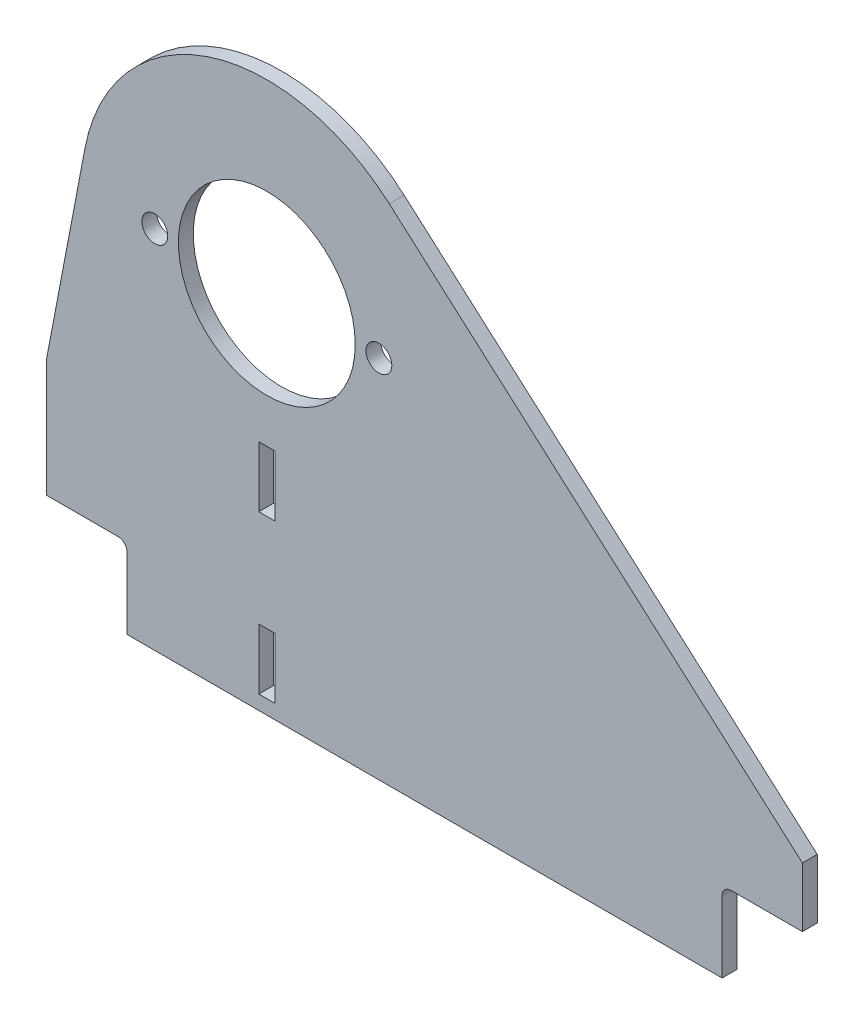
ISO-10303-21;
HEADER;
FILE_DESCRIPTION(('STEP AP214'),'2;1');
FILE_NAME('part.step','',(''),(''),'','','');
FILE_SCHEMA(('AUTOMOTIVE_DESIGN { 1 0 10303 214 1 1 1 1 }'));
ENDSEC;
DATA;
#1=APPLICATION_CONTEXT('core data for automotive mechanical design processes');
#2=APPLICATION_PROTOCOL_DEFINITION('international standard','automotive_design',2000,#1);
#3=PRODUCT_CONTEXT('',#1,'mechanical');
#4=PRODUCT('Part','Part','',(#3));
#5=PRODUCT_RELATED_PRODUCT_CATEGORY('part','',(#4));
#6=PRODUCT_DEFINITION_FORMATION('','',#4);
#7=PRODUCT_DEFINITION_CONTEXT('part definition',#1,'design');
#8=PRODUCT_DEFINITION('design','',#6,#7);
#9=PRODUCT_DEFINITION_SHAPE('','',#8);
#10=(LENGTH_UNIT() NAMED_UNIT(*) SI_UNIT(.MILLI.,.METRE.));
#11=(NAMED_UNIT(*) PLANE_ANGLE_UNIT() SI_UNIT($,.RADIAN.));
#12=(NAMED_UNIT(*) SI_UNIT($,.STERADIAN.) SOLID_ANGLE_UNIT());
#13=UNCERTAINTY_MEASURE_WITH_UNIT(LENGTH_MEASURE(1.E-05),#10,'distance_accuracy_value','');
#14=(GEOMETRIC_REPRESENTATION_CONTEXT(3) GLOBAL_UNCERTAINTY_ASSIGNED_CONTEXT((#13)) GLOBAL_UNIT_ASSIGNED_CONTEXT((#10,
#11,#12)) REPRESENTATION_CONTEXT('',''));
#15=CARTESIAN_POINT('',(0.,0.,0.));
#16=DIRECTION('',(0.,0.,1.));
#17=DIRECTION('',(1.,0.,0.));
#18=AXIS2_PLACEMENT_3D('',#15,#16,#17);
#19=CARTESIAN_POINT('',(156.076706029105,-3.00000000000025,-5.));
#20=DIRECTION('',(0.,0.,1.));
#21=DIRECTION('',(1.,0.,0.));
#22=AXIS2_PLACEMENT_3D('',#19,#20,#21);
#23=CYLINDRICAL_SURFACE('',#22,3.);
#24=CARTESIAN_POINT('',(156.076706029105,-3.00000000000025,0.));
#25=DIRECTION('',(0.,0.,-1.));
#26=DIRECTION('',(1.,0.,0.));
#27=AXIS2_PLACEMENT_3D('',#24,#25,#26);
#28=CIRCLE('',#27,3.);
#29=CARTESIAN_POINT('',(153.076706029105,-3.00000000000027,0.));
#30=VERTEX_POINT('',#29);
#31=CARTESIAN_POINT('',(156.076706029105,-2.4980018054066E-13,0.));
#32=VERTEX_POINT('',#31);
#33=EDGE_CURVE('E282',#30,#32,#28,.T.);
#34=ORIENTED_EDGE('',*,*,#33,.F.);
#35=DIRECTION('',(0.,0.,1.));
#36=VECTOR('',#35,1.);
#37=CARTESIAN_POINT('',(153.076706029105,-3.00000000000027,-5.));
#38=LINE('',#37,#36);
#39=CARTESIAN_POINT('',(153.076706029105,-3.00000000000027,-5.));
#40=VERTEX_POINT('',#39);
#41=EDGE_CURVE('E11',#40,#30,#38,.T.);
#42=ORIENTED_EDGE('',*,*,#41,.F.);
#43=CARTESIAN_POINT('',(156.076706029105,-3.00000000000025,-5.));
#44=DIRECTION('',(0.,0.,-1.));
#45=DIRECTION('',(1.,0.,0.));
#46=AXIS2_PLACEMENT_3D('',#43,#44,#45);
#47=CIRCLE('',#46,3.);
#48=CARTESIAN_POINT('',(156.076706029105,-2.4980018054066E-13,-5.));
#49=VERTEX_POINT('',#48);
#50=EDGE_CURVE('E285',#40,#49,#47,.T.);
#51=ORIENTED_EDGE('',*,*,#50,.T.);
#52=DIRECTION('',(0.,0.,1.));
#53=VECTOR('',#52,1.);
#54=CARTESIAN_POINT('',(156.076706029105,-2.4980018054066E-13,-5.));
#55=LINE('',#54,#53);
#56=EDGE_CURVE('E40',#49,#32,#55,.T.);
#57=ORIENTED_EDGE('',*,*,#56,.T.);
#58=EDGE_LOOP('',(#34,#42,#51,#57));
#59=FACE_BOUND('',#58,.T.);
#60=ADVANCED_FACE('F37',(#59),#23,.F.);
#61=CARTESIAN_POINT('',(153.076706029105,-3.00000000000027,-5.));
#62=DIRECTION('',(1.,0.,0.));
#63=DIRECTION('',(0.,0.,-1.));
#64=AXIS2_PLACEMENT_3D('',#61,#62,#63);
#65=PLANE('',#64);
#66=DIRECTION('',(0.,1.,0.));
#67=VECTOR('',#66,1.);
#68=CARTESIAN_POINT('',(153.076706029105,-3.00000000000027,0.));
#69=LINE('',#68,#67);
#70=CARTESIAN_POINT('',(153.076706029105,-27.0000000000002,0.));
#71=VERTEX_POINT('',#70);
#72=EDGE_CURVE('E289',#71,#30,#69,.T.);
#73=ORIENTED_EDGE('',*,*,#72,.F.);
#74=DIRECTION('',(0.,0.,1.));
#75=VECTOR('',#74,1.);
#76=CARTESIAN_POINT('',(153.076706029105,-27.0000000000002,-5.));
#77=LINE('',#76,#75);
#78=CARTESIAN_POINT('',(153.076706029105,-27.0000000000002,-5.));
#79=VERTEX_POINT('',#78);
#80=EDGE_CURVE('E45',#79,#71,#77,.T.);
#81=ORIENTED_EDGE('',*,*,#80,.F.);
#82=DIRECTION('',(0.,1.,0.));
#83=VECTOR('',#82,1.);
#84=CARTESIAN_POINT('',(153.076706029105,-3.00000000000027,-5.));
#85=LINE('',#84,#83);
#86=EDGE_CURVE('E319',#79,#40,#85,.T.);
#87=ORIENTED_EDGE('',*,*,#86,.T.);
#88=ORIENTED_EDGE('',*,*,#41,.T.);
#89=EDGE_LOOP('',(#73,#81,#87,#88));
#90=FACE_BOUND('',#89,.T.);
#91=ADVANCED_FACE('F385',(#90),#65,.T.);
#92=CARTESIAN_POINT('',(-47.,-27.,-5.));
#93=DIRECTION('',(0.,-1.,0.));
#94=DIRECTION('',(1.,0.,0.));
#95=AXIS2_PLACEMENT_3D('',#92,#93,#94);
#96=PLANE('',#95);
#97=DIRECTION('',(1.,0.,0.));
#98=VECTOR('',#97,1.);
#99=CARTESIAN_POINT('',(-47.,-27.,0.));
#100=LINE('',#99,#98);
#101=CARTESIAN_POINT('',(-47.,-27.,0.));
#102=VERTEX_POINT('',#101);
#103=EDGE_CURVE('E351',#102,#71,#100,.T.);
#104=ORIENTED_EDGE('',*,*,#103,.F.);
#105=DIRECTION('',(0.,0.,1.));
#106=VECTOR('',#105,1.);
#107=CARTESIAN_POINT('',(-47.,-27.,-5.));
#108=LINE('',#107,#106);
#109=CARTESIAN_POINT('',(-47.,-27.,-5.));
#110=VERTEX_POINT('',#109);
#111=EDGE_CURVE('E357',#110,#102,#108,.T.);
#112=ORIENTED_EDGE('',*,*,#111,.F.);
#113=DIRECTION('',(1.,0.,0.));
#114=VECTOR('',#113,1.);
#115=CARTESIAN_POINT('',(-47.,-27.,-5.));
#116=LINE('',#115,#114);
#117=EDGE_CURVE('E316',#110,#79,#116,.T.);
#118=ORIENTED_EDGE('',*,*,#117,.T.);
#119=ORIENTED_EDGE('',*,*,#80,.T.);
#120=EDGE_LOOP('',(#104,#112,#118,#119));
#121=FACE_BOUND('',#120,.T.);
#122=ADVANCED_FACE('F422',(#121),#96,.T.);
#123=CARTESIAN_POINT('',(-47.,-27.,-5.));
#124=DIRECTION('',(-1.,0.,0.));
#125=DIRECTION('',(0.,0.,1.));
#126=AXIS2_PLACEMENT_3D('',#123,#124,#125);
#127=PLANE('',#126);
#128=DIRECTION('',(0.,-1.,0.));
#129=VECTOR('',#128,1.);
#130=CARTESIAN_POINT('',(-47.,-27.,0.));
#131=LINE('',#130,#129);
#132=CARTESIAN_POINT('',(-47.,-3.00000000000003,0.));
#133=VERTEX_POINT('',#132);
#134=EDGE_CURVE('E348',#133,#102,#131,.T.);
#135=ORIENTED_EDGE('',*,*,#134,.F.);
#136=DIRECTION('',(0.,0.,1.));
#137=VECTOR('',#136,1.);
#138=CARTESIAN_POINT('',(-47.,-3.00000000000003,-5.));
#139=LINE('',#138,#137);
#140=CARTESIAN_POINT('',(-47.,-3.00000000000003,-5.));
#141=VERTEX_POINT('',#140);
#142=EDGE_CURVE('E359',#141,#133,#139,.T.);
#143=ORIENTED_EDGE('',*,*,#142,.F.);
#144=DIRECTION('',(0.,-1.,0.));
#145=VECTOR('',#144,1.);
#146=CARTESIAN_POINT('',(-47.,-27.,-5.));
#147=LINE('',#146,#145);
#148=EDGE_CURVE('E313',#141,#110,#147,.T.);
#149=ORIENTED_EDGE('',*,*,#148,.T.);
#150=ORIENTED_EDGE('',*,*,#111,.T.);
#151=EDGE_LOOP('',(#135,#143,#149,#150));
#152=FACE_BOUND('',#151,.T.);
#153=ADVANCED_FACE('F419',(#152),#127,.T.);
#154=CARTESIAN_POINT('',(-50.,-3.00000000000003,-5.));
#155=DIRECTION('',(0.,0.,1.));
#156=DIRECTION('',(1.,0.,0.));
#157=AXIS2_PLACEMENT_3D('',#154,#155,#156);
#158=CYLINDRICAL_SURFACE('',#157,3.);
#159=CARTESIAN_POINT('',(-50.,-3.00000000000003,0.));
#160=DIRECTION('',(0.,0.,-1.));
#161=DIRECTION('',(1.,0.,0.));
#162=AXIS2_PLACEMENT_3D('',#159,#160,#161);
#163=CIRCLE('',#162,3.);
#164=CARTESIAN_POINT('',(-50.,0.,0.));
#165=VERTEX_POINT('',#164);
#166=EDGE_CURVE('E345',#165,#133,#163,.T.);
#167=ORIENTED_EDGE('',*,*,#166,.F.);
#168=DIRECTION('',(0.,0.,1.));
#169=VECTOR('',#168,1.);
#170=CARTESIAN_POINT('',(-50.,0.,-5.));
#171=LINE('',#170,#169);
#172=CARTESIAN_POINT('',(-50.,0.,-5.));
#173=VERTEX_POINT('',#172);
#174=EDGE_CURVE('E361',#173,#165,#171,.T.);
#175=ORIENTED_EDGE('',*,*,#174,.F.);
#176=CARTESIAN_POINT('',(-50.,-3.00000000000003,-5.));
#177=DIRECTION('',(0.,0.,-1.));
#178=DIRECTION('',(1.,0.,0.));
#179=AXIS2_PLACEMENT_3D('',#176,#177,#178);
#180=CIRCLE('',#179,3.);
#181=EDGE_CURVE('E310',#173,#141,#180,.T.);
#182=ORIENTED_EDGE('',*,*,#181,.T.);
#183=ORIENTED_EDGE('',*,*,#142,.T.);
#184=EDGE_LOOP('',(#167,#175,#182,#183));
#185=FACE_BOUND('',#184,.T.);
#186=ADVANCED_FACE('F416',(#185),#158,.F.);
#187=CARTESIAN_POINT('',(-50.,0.,-5.));
#188=DIRECTION('',(0.,-1.,0.));
#189=DIRECTION('',(0.,0.,-1.));
#190=AXIS2_PLACEMENT_3D('',#187,#188,#189);
#191=PLANE('',#190);
#192=DIRECTION('',(1.,0.,0.));
#193=VECTOR('',#192,1.);
#194=CARTESIAN_POINT('',(-50.,0.,0.));
#195=LINE('',#194,#193);
#196=CARTESIAN_POINT('',(-74.,0.,0.));
#197=VERTEX_POINT('',#196);
#198=EDGE_CURVE('E342',#197,#165,#195,.T.);
#199=ORIENTED_EDGE('',*,*,#198,.F.);
#200=DIRECTION('',(0.,0.,1.));
#201=VECTOR('',#200,1.);
#202=CARTESIAN_POINT('',(-74.,0.,-5.));
#203=LINE('',#202,#201);
#204=CARTESIAN_POINT('',(-74.,0.,-5.));
#205=VERTEX_POINT('',#204);
#206=EDGE_CURVE('E363',#205,#197,#203,.T.);
#207=ORIENTED_EDGE('',*,*,#206,.F.);
#208=DIRECTION('',(1.,0.,0.));
#209=VECTOR('',#208,1.);
#210=CARTESIAN_POINT('',(-50.,0.,-5.));
#211=LINE('',#210,#209);
#212=EDGE_CURVE('E307',#205,#173,#211,.T.);
#213=ORIENTED_EDGE('',*,*,#212,.T.);
#214=ORIENTED_EDGE('',*,*,#174,.T.);
#215=EDGE_LOOP('',(#199,#207,#213,#214));
#216=FACE_BOUND('',#215,.T.);
#217=ADVANCED_FACE('F412',(#216),#191,.T.);
#218=CARTESIAN_POINT('',(-74.0000000000001,40.,-5.));
#219=DIRECTION('',(-1.,0.,0.));
#220=DIRECTION('',(0.,-1.,0.));
#221=AXIS2_PLACEMENT_3D('',#218,#219,#220);
#222=PLANE('',#221);
#223=DIRECTION('',(0.,-1.,0.));
#224=VECTOR('',#223,1.);
#225=CARTESIAN_POINT('',(-74.0000000000001,40.,0.));
#226=LINE('',#225,#224);
#227=CARTESIAN_POINT('',(-74.0000000000001,40.,0.));
#228=VERTEX_POINT('',#227);
#229=EDGE_CURVE('E339',#228,#197,#226,.T.);
#230=ORIENTED_EDGE('',*,*,#229,.F.);
#231=DIRECTION('',(0.,0.,1.));
#232=VECTOR('',#231,1.);
#233=CARTESIAN_POINT('',(-74.0000000000001,40.,-5.));
#234=LINE('',#233,#232);
#235=CARTESIAN_POINT('',(-74.0000000000001,40.,-5.));
#236=VERTEX_POINT('',#235);
#237=EDGE_CURVE('E365',#236,#228,#234,.T.);
#238=ORIENTED_EDGE('',*,*,#237,.F.);
#239=DIRECTION('',(0.,-1.,0.));
#240=VECTOR('',#239,1.);
#241=CARTESIAN_POINT('',(-74.0000000000001,40.,-5.));
#242=LINE('',#241,#240);
#243=EDGE_CURVE('E304',#236,#205,#242,.T.);
#244=ORIENTED_EDGE('',*,*,#243,.T.);
#245=ORIENTED_EDGE('',*,*,#206,.T.);
#246=EDGE_LOOP('',(#230,#238,#244,#245));
#247=FACE_BOUND('',#246,.T.);
#248=ADVANCED_FACE('F408',(#247),#222,.T.);
#249=CARTESIAN_POINT('',(-61.1500399105737,107.459829597057,-5.));
#250=DIRECTION('',(-0.982337311791725,0.187118694581296,0.));
#251=DIRECTION('',(-0.187118694581296,-0.982337311791725,0.));
#252=AXIS2_PLACEMENT_3D('',#249,#250,#251);
#253=PLANE('',#252);
#254=DIRECTION('',(-0.187118694581296,-0.982337311791725,0.));
#255=VECTOR('',#254,1.);
#256=CARTESIAN_POINT('',(-61.1500399105737,107.459829597057,0.));
#257=LINE('',#256,#255);
#258=CARTESIAN_POINT('',(-61.1500399105737,107.459829597057,0.));
#259=VERTEX_POINT('',#258);
#260=EDGE_CURVE('E336',#259,#228,#257,.T.);
#261=ORIENTED_EDGE('',*,*,#260,.F.);
#262=DIRECTION('',(0.,0.,1.));
#263=VECTOR('',#262,1.);
#264=CARTESIAN_POINT('',(-61.1500399105737,107.459829597057,-5.));
#265=LINE('',#264,#263);
#266=CARTESIAN_POINT('',(-61.1500399105737,107.459829597057,-5.));
#267=VERTEX_POINT('',#266);
#268=EDGE_CURVE('E367',#267,#259,#265,.T.);
#269=ORIENTED_EDGE('',*,*,#268,.F.);
#270=DIRECTION('',(-0.187118694581296,-0.982337311791725,0.));
#271=VECTOR('',#270,1.);
#272=CARTESIAN_POINT('',(-61.1500399105737,107.459829597057,-5.));
#273=LINE('',#272,#271);
#274=EDGE_CURVE('E301',#267,#236,#273,.T.);
#275=ORIENTED_EDGE('',*,*,#274,.T.);
#276=ORIENTED_EDGE('',*,*,#237,.T.);
#277=EDGE_LOOP('',(#261,#269,#275,#276));
#278=FACE_BOUND('',#277,.T.);
#279=ADVANCED_FACE('F404',(#278),#253,.T.);
#280=CARTESIAN_POINT('',(0.,95.8117780527352,-5.));
#281=DIRECTION('',(0.,0.,1.));
#282=DIRECTION('',(1.,0.,0.));
#283=AXIS2_PLACEMENT_3D('',#280,#281,#282);
#284=CYLINDRICAL_SURFACE('',#283,62.2495340210989);
#285=CARTESIAN_POINT('',(0.,95.8117780527352,0.));
#286=DIRECTION('',(0.,0.,1.));
#287=DIRECTION('',(1.,0.,0.));
#288=AXIS2_PLACEMENT_3D('',#285,#286,#287);
#289=CIRCLE('',#288,62.2495340210989);
#290=CARTESIAN_POINT('',(41.1738996769918,142.499190395175,0.));
#291=VERTEX_POINT('',#290);
#292=EDGE_CURVE('E333',#291,#259,#289,.T.);
#293=ORIENTED_EDGE('',*,*,#292,.F.);
#294=DIRECTION('',(0.,0.,1.));
#295=VECTOR('',#294,1.);
#296=CARTESIAN_POINT('',(41.1738996769918,142.499190395175,-5.));
#297=LINE('',#296,#295);
#298=CARTESIAN_POINT('',(41.1738996769918,142.499190395175,-5.));
#299=VERTEX_POINT('',#298);
#300=EDGE_CURVE('E369',#299,#291,#297,.T.);
#301=ORIENTED_EDGE('',*,*,#300,.F.);
#302=CARTESIAN_POINT('',(0.,95.8117780527352,-5.));
#303=DIRECTION('',(0.,0.,1.));
#304=DIRECTION('',(1.,0.,0.));
#305=AXIS2_PLACEMENT_3D('',#302,#303,#304);
#306=CIRCLE('',#305,62.2495340210989);
#307=EDGE_CURVE('E298',#299,#267,#306,.T.);
#308=ORIENTED_EDGE('',*,*,#307,.T.);
#309=ORIENTED_EDGE('',*,*,#268,.T.);
#310=EDGE_LOOP('',(#293,#301,#308,#309));
#311=FACE_BOUND('',#310,.T.);
#312=ADVANCED_FACE('F400',(#311),#284,.T.);
#313=CARTESIAN_POINT('',(180.076706029105,19.9999999999997,-5.));
#314=DIRECTION('',(0.661433058487415,0.750004206081528,0.));
#315=DIRECTION('',(-0.750004206081528,0.661433058487415,0.));
#316=AXIS2_PLACEMENT_3D('',#313,#314,#315);
#317=PLANE('',#316);
#318=DIRECTION('',(-0.750004206081528,0.661433058487415,0.));
#319=VECTOR('',#318,1.);
#320=CARTESIAN_POINT('',(180.076706029105,19.9999999999997,0.));
#321=LINE('',#320,#319);
#322=CARTESIAN_POINT('',(180.076706029105,19.9999999999997,0.));
#323=VERTEX_POINT('',#322);
#324=EDGE_CURVE('E330',#323,#291,#321,.T.);
#325=ORIENTED_EDGE('',*,*,#324,.F.);
#326=DIRECTION('',(0.,0.,1.));
#327=VECTOR('',#326,1.);
#328=CARTESIAN_POINT('',(180.076706029105,19.9999999999997,-5.));
#329=LINE('',#328,#327);
#330=CARTESIAN_POINT('',(180.076706029105,19.9999999999997,-5.));
#331=VERTEX_POINT('',#330);
#332=EDGE_CURVE('E371',#331,#323,#329,.T.);
#333=ORIENTED_EDGE('',*,*,#332,.F.);
#334=DIRECTION('',(-0.750004206081528,0.661433058487415,0.));
#335=VECTOR('',#334,1.);
#336=CARTESIAN_POINT('',(180.076706029105,19.9999999999997,-5.));
#337=LINE('',#336,#335);
#338=EDGE_CURVE('E295',#331,#299,#337,.T.);
#339=ORIENTED_EDGE('',*,*,#338,.T.);
#340=ORIENTED_EDGE('',*,*,#300,.T.);
#341=EDGE_LOOP('',(#325,#333,#339,#340));
#342=FACE_BOUND('',#341,.T.);
#343=ADVANCED_FACE('F398',(#342),#317,.T.);
#344=CARTESIAN_POINT('',(180.076706029105,-2.4980018054066E-13,-5.));
#345=DIRECTION('',(1.,0.,0.));
#346=DIRECTION('',(0.,0.,-1.));
#347=AXIS2_PLACEMENT_3D('',#344,#345,#346);
#348=PLANE('',#347);
#349=DIRECTION('',(0.,1.,0.));
#350=VECTOR('',#349,1.);
#351=CARTESIAN_POINT('',(180.076706029105,-2.4980018054066E-13,0.));
#352=LINE('',#351,#350);
#353=CARTESIAN_POINT('',(180.076706029105,-2.4980018054066E-13,0.));
#354=VERTEX_POINT('',#353);
#355=EDGE_CURVE('E327',#354,#323,#352,.T.);
#356=ORIENTED_EDGE('',*,*,#355,.F.);
#357=DIRECTION('',(0.,0.,1.));
#358=VECTOR('',#357,1.);
#359=CARTESIAN_POINT('',(180.076706029105,-2.4980018054066E-13,-5.));
#360=LINE('',#359,#358);
#361=CARTESIAN_POINT('',(180.076706029105,-2.4980018054066E-13,-5.));
#362=VERTEX_POINT('',#361);
#363=EDGE_CURVE('E372',#362,#354,#360,.T.);
#364=ORIENTED_EDGE('',*,*,#363,.F.);
#365=DIRECTION('',(0.,1.,0.));
#366=VECTOR('',#365,1.);
#367=CARTESIAN_POINT('',(180.076706029105,-2.4980018054066E-13,-5.));
#368=LINE('',#367,#366);
#369=EDGE_CURVE('E292',#362,#331,#368,.T.);
#370=ORIENTED_EDGE('',*,*,#369,.T.);
#371=ORIENTED_EDGE('',*,*,#332,.T.);
#372=EDGE_LOOP('',(#356,#364,#370,#371));
#373=FACE_BOUND('',#372,.T.);
#374=ADVANCED_FACE('F394',(#373),#348,.T.);
#375=CARTESIAN_POINT('',(180.076706029105,-2.4980018054066E-13,-5.));
#376=DIRECTION('',(0.,-1.,0.));
#377=DIRECTION('',(0.,0.,-1.));
#378=AXIS2_PLACEMENT_3D('',#375,#376,#377);
#379=PLANE('',#378);
#380=DIRECTION('',(1.,0.,0.));
#381=VECTOR('',#380,1.);
#382=CARTESIAN_POINT('',(180.076706029105,-2.4980018054066E-13,0.));
#383=LINE('',#382,#381);
#384=EDGE_CURVE('E324',#32,#354,#383,.T.);
#385=ORIENTED_EDGE('',*,*,#384,.F.);
#386=ORIENTED_EDGE('',*,*,#56,.F.);
#387=DIRECTION('',(1.,0.,0.));
#388=VECTOR('',#387,1.);
#389=CARTESIAN_POINT('',(180.076706029105,-2.4980018054066E-13,-5.));
#390=LINE('',#389,#388);
#391=EDGE_CURVE('E288',#49,#362,#390,.T.);
#392=ORIENTED_EDGE('',*,*,#391,.T.);
#393=ORIENTED_EDGE('',*,*,#363,.T.);
#394=EDGE_LOOP('',(#385,#386,#392,#393));
#395=FACE_BOUND('',#394,.T.);
#396=ADVANCED_FACE('F380',(#395),#379,.T.);
#397=CARTESIAN_POINT('',(156.076706029105,-3.00000000000025,-5.));
#398=DIRECTION('',(0.,0.,1.));
#399=DIRECTION('',(1.,0.,0.));
#400=AXIS2_PLACEMENT_3D('',#397,#398,#399);
#401=PLANE('',#400);
#402=CARTESIAN_POINT('',(2.70000000000001,-22.2,-5.));
#403=CARTESIAN_POINT('',(-2.69999999999998,-22.2,-5.));
#404=B_SPLINE_CURVE_WITH_KNOTS('',1,(#402,#403),.UNSPECIFIED.,.F.,.F.,(2,2),(0.5,
0.604651162790698),.UNSPECIFIED.);
#405=CARTESIAN_POINT('',(2.70000000000001,-22.2,-5.));
#406=VERTEX_POINT('',#405);
#407=CARTESIAN_POINT('',(-2.69999999999998,-22.2,-5.));
#408=VERTEX_POINT('',#407);
#409=EDGE_CURVE('E200',#406,#408,#404,.T.);
#410=ORIENTED_EDGE('',*,*,#409,.F.);
#411=CARTESIAN_POINT('',(2.70000000000001,-1.79999999999999,-5.));
#412=CARTESIAN_POINT('',(2.70000000000001,-22.2,-5.));
#413=B_SPLINE_CURVE_WITH_KNOTS('',1,(#411,#412),.UNSPECIFIED.,.F.,.F.,(2,2),(0.104651162790698,
0.5),.UNSPECIFIED.);
#414=CARTESIAN_POINT('',(2.70000000000001,-1.79999999999999,-5.));
#415=VERTEX_POINT('',#414);
#416=EDGE_CURVE('E193',#415,#406,#413,.T.);
#417=ORIENTED_EDGE('',*,*,#416,.F.);
#418=CARTESIAN_POINT('',(-2.69999999999998,-1.79999999999999,-5.));
#419=CARTESIAN_POINT('',(2.70000000000001,-1.79999999999999,-5.));
#420=B_SPLINE_CURVE_WITH_KNOTS('',1,(#418,#419),.UNSPECIFIED.,.F.,.F.,(2,2),(0.,
0.104651162790698),.UNSPECIFIED.);
#421=CARTESIAN_POINT('',(-2.69999999999998,-1.79999999999999,-5.));
#422=VERTEX_POINT('',#421);
#423=EDGE_CURVE('E204',#422,#415,#420,.T.);
#424=ORIENTED_EDGE('',*,*,#423,.F.);
#425=CARTESIAN_POINT('',(-2.69999999999998,-22.2,-5.));
#426=CARTESIAN_POINT('',(-2.69999999999998,-1.79999999999999,-5.));
#427=B_SPLINE_CURVE_WITH_KNOTS('',1,(#425,#426),.UNSPECIFIED.,.F.,.F.,(2,2),(0.604651162790698,
1.),.UNSPECIFIED.);
#428=EDGE_CURVE('E53',#408,#422,#427,.T.);
#429=ORIENTED_EDGE('',*,*,#428,.F.);
#430=EDGE_LOOP('',(#410,#417,#424,#429));
#431=FACE_BOUND('',#430,.T.);
#432=CARTESIAN_POINT('',(2.70000000000001,30.8796405580983,-5.));
#433=CARTESIAN_POINT('',(-2.69999999999998,30.8796405580983,-5.));
#434=B_SPLINE_CURVE_WITH_KNOTS('',1,(#432,#433),.UNSPECIFIED.,.F.,.F.,(2,2),(0.5,
0.604651162790698),.UNSPECIFIED.);
#435=CARTESIAN_POINT('',(2.70000000000001,30.8796405580983,-5.));
#436=VERTEX_POINT('',#435);
#437=CARTESIAN_POINT('',(-2.69999999999998,30.8796405580983,-5.));
#438=VERTEX_POINT('',#437);
#439=EDGE_CURVE('E221',#436,#438,#434,.T.);
#440=ORIENTED_EDGE('',*,*,#439,.F.);
#441=CARTESIAN_POINT('',(2.70000000000001,51.2796405580983,-5.));
#442=CARTESIAN_POINT('',(2.70000000000001,30.8796405580983,-5.));
#443=B_SPLINE_CURVE_WITH_KNOTS('',1,(#441,#442),.UNSPECIFIED.,.F.,.F.,(2,2),(0.104651162790698,
0.5),.UNSPECIFIED.);
#444=CARTESIAN_POINT('',(2.70000000000001,51.2796405580983,-5.));
#445=VERTEX_POINT('',#444);
#446=EDGE_CURVE('E229',#445,#436,#443,.T.);
#447=ORIENTED_EDGE('',*,*,#446,.F.);
#448=CARTESIAN_POINT('',(-2.69999999999998,51.2796405580983,-5.));
#449=CARTESIAN_POINT('',(2.70000000000001,51.2796405580983,-5.));
#450=B_SPLINE_CURVE_WITH_KNOTS('',1,(#448,#449),.UNSPECIFIED.,.F.,.F.,(2,2),(0.,
0.104651162790698),.UNSPECIFIED.);
#451=CARTESIAN_POINT('',(-2.69999999999998,51.2796405580983,-5.));
#452=VERTEX_POINT('',#451);
#453=EDGE_CURVE('E237',#452,#445,#450,.T.);
#454=ORIENTED_EDGE('',*,*,#453,.F.);
#455=CARTESIAN_POINT('',(-2.69999999999998,30.8796405580983,-5.));
#456=CARTESIAN_POINT('',(-2.69999999999998,51.2796405580983,-5.));
#457=B_SPLINE_CURVE_WITH_KNOTS('',1,(#455,#456),.UNSPECIFIED.,.F.,.F.,(2,2),(0.604651162790698,
1.),.UNSPECIFIED.);
#458=EDGE_CURVE('E61',#438,#452,#457,.T.);
#459=ORIENTED_EDGE('',*,*,#458,.F.);
#460=EDGE_LOOP('',(#440,#447,#454,#459));
#461=FACE_BOUND('',#460,.T.);
#462=CARTESIAN_POINT('',(37.6749999999999,95.8117780527354,-5.));
#463=DIRECTION('',(0.,0.,1.));
#464=DIRECTION('',(1.,0.,0.));
#465=AXIS2_PLACEMENT_3D('',#462,#463,#464);
#466=CIRCLE('',#465,4.35);
#467=CARTESIAN_POINT('',(42.0249999999999,95.8117780527354,-5.));
#468=VERTEX_POINT('',#467);
#469=EDGE_CURVE('E267',#468,#468,#466,.T.);
#470=ORIENTED_EDGE('',*,*,#469,.T.);
#471=EDGE_LOOP('',(#470));
#472=FACE_BOUND('',#471,.T.);
#473=CARTESIAN_POINT('',(-37.6750000000001,95.8117780527352,-5.));
#474=DIRECTION('',(0.,0.,1.));
#475=DIRECTION('',(1.,0.,0.));
#476=AXIS2_PLACEMENT_3D('',#473,#474,#475);
#477=CIRCLE('',#476,4.35000000000023);
#478=CARTESIAN_POINT('',(-33.3249999999999,95.8117780527352,-5.));
#479=VERTEX_POINT('',#478);
#480=EDGE_CURVE('E273',#479,#479,#477,.T.);
#481=ORIENTED_EDGE('',*,*,#480,.T.);
#482=EDGE_LOOP('',(#481));
#483=FACE_BOUND('',#482,.T.);
#484=CARTESIAN_POINT('',(0.,95.8117780527352,-5.));
#485=DIRECTION('',(0.,0.,1.));
#486=DIRECTION('',(1.,0.,0.));
#487=AXIS2_PLACEMENT_3D('',#484,#485,#486);
#488=CIRCLE('',#487,29.732137494637);
#489=CARTESIAN_POINT('',(29.732137494637,95.8117780527352,-5.));
#490=VERTEX_POINT('',#489);
#491=EDGE_CURVE('E279',#490,#490,#488,.T.);
#492=ORIENTED_EDGE('',*,*,#491,.T.);
#493=EDGE_LOOP('',(#492));
#494=FACE_BOUND('',#493,.T.);
#495=ORIENTED_EDGE('',*,*,#50,.F.);
#496=ORIENTED_EDGE('',*,*,#86,.F.);
#497=ORIENTED_EDGE('',*,*,#117,.F.);
#498=ORIENTED_EDGE('',*,*,#148,.F.);
#499=ORIENTED_EDGE('',*,*,#181,.F.);
#500=ORIENTED_EDGE('',*,*,#212,.F.);
#501=ORIENTED_EDGE('',*,*,#243,.F.);
#502=ORIENTED_EDGE('',*,*,#274,.F.);
#503=ORIENTED_EDGE('',*,*,#307,.F.);
#504=ORIENTED_EDGE('',*,*,#338,.F.);
#505=ORIENTED_EDGE('',*,*,#369,.F.);
#506=ORIENTED_EDGE('',*,*,#391,.F.);
#507=EDGE_LOOP('',(#495,#496,#497,#498,#499,#500,#501,#502,#503,#504,#505,#506));
#508=FACE_BOUND('',#507,.T.);
#509=ADVANCED_FACE('F388',(#431,#461,#472,#483,#494,#508),#401,.F.);
#510=CARTESIAN_POINT('',(156.076706029105,-3.00000000000025,0.));
#511=DIRECTION('',(0.,0.,1.));
#512=DIRECTION('',(1.,0.,0.));
#513=AXIS2_PLACEMENT_3D('',#510,#511,#512);
#514=PLANE('',#513);
#515=DIRECTION('',(0.,-1.,0.));
#516=VECTOR('',#515,1.);
#517=CARTESIAN_POINT('',(2.70000000000001,-1.79999999999999,0.));
#518=LINE('',#517,#516);
#519=CARTESIAN_POINT('',(2.70000000000001,-1.79999999999999,0.));
#520=VERTEX_POINT('',#519);
#521=CARTESIAN_POINT('',(2.70000000000001,-22.2,0.));
#522=VERTEX_POINT('',#521);
#523=EDGE_CURVE('E190',#520,#522,#518,.T.);
#524=ORIENTED_EDGE('',*,*,#523,.T.);
#525=DIRECTION('',(-1.,0.,0.));
#526=VECTOR('',#525,1.);
#527=CARTESIAN_POINT('',(2.70000000000001,-22.2,0.));
#528=LINE('',#527,#526);
#529=CARTESIAN_POINT('',(-2.69999999999998,-22.2,0.));
#530=VERTEX_POINT('',#529);
#531=EDGE_CURVE('E176',#522,#530,#528,.T.);
#532=ORIENTED_EDGE('',*,*,#531,.T.);
#533=DIRECTION('',(0.,1.,0.));
#534=VECTOR('',#533,1.);
#535=CARTESIAN_POINT('',(-2.69999999999998,-22.2,0.));
#536=LINE('',#535,#534);
#537=CARTESIAN_POINT('',(-2.69999999999998,-1.79999999999999,0.));
#538=VERTEX_POINT('',#537);
#539=EDGE_CURVE('E211',#530,#538,#536,.T.);
#540=ORIENTED_EDGE('',*,*,#539,.T.);
#541=DIRECTION('',(1.,0.,0.));
#542=VECTOR('',#541,1.);
#543=CARTESIAN_POINT('',(-2.69999999999998,-1.79999999999999,0.));
#544=LINE('',#543,#542);
#545=EDGE_CURVE('E198',#538,#520,#544,.T.);
#546=ORIENTED_EDGE('',*,*,#545,.T.);
#547=EDGE_LOOP('',(#524,#532,#540,#546));
#548=FACE_BOUND('',#547,.T.);
#549=DIRECTION('',(0.,-1.,0.));
#550=VECTOR('',#549,1.);
#551=CARTESIAN_POINT('',(2.70000000000001,51.2796405580983,0.));
#552=LINE('',#551,#550);
#553=CARTESIAN_POINT('',(2.70000000000001,51.2796405580983,0.));
#554=VERTEX_POINT('',#553);
#555=CARTESIAN_POINT('',(2.70000000000001,30.8796405580983,0.));
#556=VERTEX_POINT('',#555);
#557=EDGE_CURVE('E220',#554,#556,#552,.T.);
#558=ORIENTED_EDGE('',*,*,#557,.T.);
#559=DIRECTION('',(-1.,0.,0.));
#560=VECTOR('',#559,1.);
#561=CARTESIAN_POINT('',(2.70000000000001,30.8796405580983,0.));
#562=LINE('',#561,#560);
#563=CARTESIAN_POINT('',(-2.69999999999998,30.8796405580983,0.));
#564=VERTEX_POINT('',#563);
#565=EDGE_CURVE('E260',#556,#564,#562,.T.);
#566=ORIENTED_EDGE('',*,*,#565,.T.);
#567=DIRECTION('',(0.,1.,0.));
#568=VECTOR('',#567,1.);
#569=CARTESIAN_POINT('',(-2.69999999999998,30.8796405580983,0.));
#570=LINE('',#569,#568);
#571=CARTESIAN_POINT('',(-2.69999999999998,51.2796405580983,0.));
#572=VERTEX_POINT('',#571);
#573=EDGE_CURVE('E256',#564,#572,#570,.T.);
#574=ORIENTED_EDGE('',*,*,#573,.T.);
#575=DIRECTION('',(1.,0.,0.));
#576=VECTOR('',#575,1.);
#577=CARTESIAN_POINT('',(-2.69999999999998,51.2796405580983,0.));
#578=LINE('',#577,#576);
#579=EDGE_CURVE('E251',#572,#554,#578,.T.);
#580=ORIENTED_EDGE('',*,*,#579,.T.);
#581=EDGE_LOOP('',(#558,#566,#574,#580));
#582=FACE_BOUND('',#581,.T.);
#583=CARTESIAN_POINT('',(37.6749999999999,95.8117780527354,0.));
#584=DIRECTION('',(0.,0.,1.));
#585=DIRECTION('',(1.,0.,0.));
#586=AXIS2_PLACEMENT_3D('',#583,#584,#585);
#587=CIRCLE('',#586,4.35);
#588=CARTESIAN_POINT('',(42.0249999999999,95.8117780527354,0.));
#589=VERTEX_POINT('',#588);
#590=EDGE_CURVE('E216',#589,#589,#587,.T.);
#591=ORIENTED_EDGE('',*,*,#590,.F.);
#592=EDGE_LOOP('',(#591));
#593=FACE_BOUND('',#592,.T.);
#594=CARTESIAN_POINT('',(-37.6750000000001,95.8117780527352,0.));
#595=DIRECTION('',(0.,0.,1.));
#596=DIRECTION('',(1.,0.,0.));
#597=AXIS2_PLACEMENT_3D('',#594,#595,#596);
#598=CIRCLE('',#597,4.35000000000023);
#599=CARTESIAN_POINT('',(-33.3249999999999,95.8117780527352,0.));
#600=VERTEX_POINT('',#599);
#601=EDGE_CURVE('E270',#600,#600,#598,.T.);
#602=ORIENTED_EDGE('',*,*,#601,.F.);
#603=EDGE_LOOP('',(#602));
#604=FACE_BOUND('',#603,.T.);
#605=CARTESIAN_POINT('',(0.,95.8117780527352,0.));
#606=DIRECTION('',(0.,0.,1.));
#607=DIRECTION('',(1.,0.,0.));
#608=AXIS2_PLACEMENT_3D('',#605,#606,#607);
#609=CIRCLE('',#608,29.732137494637);
#610=CARTESIAN_POINT('',(29.732137494637,95.8117780527352,0.));
#611=VERTEX_POINT('',#610);
#612=EDGE_CURVE('E276',#611,#611,#609,.T.);
#613=ORIENTED_EDGE('',*,*,#612,.F.);
#614=EDGE_LOOP('',(#613));
#615=FACE_BOUND('',#614,.T.);
#616=ORIENTED_EDGE('',*,*,#33,.T.);
#617=ORIENTED_EDGE('',*,*,#384,.T.);
#618=ORIENTED_EDGE('',*,*,#355,.T.);
#619=ORIENTED_EDGE('',*,*,#324,.T.);
#620=ORIENTED_EDGE('',*,*,#292,.T.);
#621=ORIENTED_EDGE('',*,*,#260,.T.);
#622=ORIENTED_EDGE('',*,*,#229,.T.);
#623=ORIENTED_EDGE('',*,*,#198,.T.);
#624=ORIENTED_EDGE('',*,*,#166,.T.);
#625=ORIENTED_EDGE('',*,*,#134,.T.);
#626=ORIENTED_EDGE('',*,*,#103,.T.);
#627=ORIENTED_EDGE('',*,*,#72,.T.);
#628=EDGE_LOOP('',(#616,#617,#618,#619,#620,#621,#622,#623,#624,#625,#626,#627));
#629=FACE_BOUND('',#628,.T.);
#630=ADVANCED_FACE('F196',(#548,#582,#593,#604,#615,#629),#514,.T.);
#631=CARTESIAN_POINT('',(0.,95.8117780527352,-5.));
#632=DIRECTION('',(0.,0.,1.));
#633=DIRECTION('',(1.,0.,0.));
#634=AXIS2_PLACEMENT_3D('',#631,#632,#633);
#635=CYLINDRICAL_SURFACE('',#634,29.732137494637);
#636=ORIENTED_EDGE('',*,*,#491,.F.);
#637=EDGE_LOOP('',(#636));
#638=FACE_BOUND('',#637,.T.);
#639=ORIENTED_EDGE('',*,*,#612,.T.);
#640=EDGE_LOOP('',(#639));
#641=FACE_BOUND('',#640,.T.);
#642=ADVANCED_FACE('F531',(#638,#641),#635,.F.);
#643=CARTESIAN_POINT('',(-37.6750000000001,95.8117780527352,-5.));
#644=DIRECTION('',(0.,0.,1.));
#645=DIRECTION('',(1.,0.,0.));
#646=AXIS2_PLACEMENT_3D('',#643,#644,#645);
#647=CYLINDRICAL_SURFACE('',#646,4.35000000000023);
#648=ORIENTED_EDGE('',*,*,#480,.F.);
#649=EDGE_LOOP('',(#648));
#650=FACE_BOUND('',#649,.T.);
#651=ORIENTED_EDGE('',*,*,#601,.T.);
#652=EDGE_LOOP('',(#651));
#653=FACE_BOUND('',#652,.T.);
#654=ADVANCED_FACE('F540',(#650,#653),#647,.F.);
#655=CARTESIAN_POINT('',(37.6749999999999,95.8117780527354,-5.));
#656=DIRECTION('',(0.,0.,1.));
#657=DIRECTION('',(1.,0.,0.));
#658=AXIS2_PLACEMENT_3D('',#655,#656,#657);
#659=CYLINDRICAL_SURFACE('',#658,4.35);
#660=ORIENTED_EDGE('',*,*,#469,.F.);
#661=EDGE_LOOP('',(#660));
#662=FACE_BOUND('',#661,.T.);
#663=ORIENTED_EDGE('',*,*,#590,.T.);
#664=EDGE_LOOP('',(#663));
#665=FACE_BOUND('',#664,.T.);
#666=ADVANCED_FACE('F550',(#662,#665),#659,.F.);
#667=CARTESIAN_POINT('',(2.70000000000001,51.2796405580983,5.));
#668=DIRECTION('',(1.,0.,0.));
#669=DIRECTION('',(0.,0.,-1.));
#670=AXIS2_PLACEMENT_3D('',#667,#668,#669);
#671=PLANE('',#670);
#672=DIRECTION('',(0.,0.,-1.));
#673=VECTOR('',#672,1.);
#674=CARTESIAN_POINT('',(2.70000000000001,51.2796405580983,5.));
#675=LINE('',#674,#673);
#676=EDGE_CURVE('E254',#554,#445,#675,.T.);
#677=ORIENTED_EDGE('',*,*,#676,.T.);
#678=ORIENTED_EDGE('',*,*,#446,.T.);
#679=DIRECTION('',(0.,0.,-1.));
#680=VECTOR('',#679,1.);
#681=CARTESIAN_POINT('',(2.70000000000001,30.8796405580983,5.));
#682=LINE('',#681,#680);
#683=EDGE_CURVE('E250',#556,#436,#682,.T.);
#684=ORIENTED_EDGE('',*,*,#683,.F.);
#685=ORIENTED_EDGE('',*,*,#557,.F.);
#686=EDGE_LOOP('',(#677,#678,#684,#685));
#687=FACE_BOUND('',#686,.T.);
#688=ADVANCED_FACE('F560',(#687),#671,.F.);
#689=CARTESIAN_POINT('',(2.70000000000001,30.8796405580983,5.));
#690=DIRECTION('',(0.,-1.,0.));
#691=DIRECTION('',(1.,0.,0.));
#692=AXIS2_PLACEMENT_3D('',#689,#690,#691);
#693=PLANE('',#692);
#694=ORIENTED_EDGE('',*,*,#683,.T.);
#695=ORIENTED_EDGE('',*,*,#439,.T.);
#696=DIRECTION('',(0.,0.,-1.));
#697=VECTOR('',#696,1.);
#698=CARTESIAN_POINT('',(-2.69999999999998,30.8796405580983,5.));
#699=LINE('',#698,#697);
#700=EDGE_CURVE('E259',#564,#438,#699,.T.);
#701=ORIENTED_EDGE('',*,*,#700,.F.);
#702=ORIENTED_EDGE('',*,*,#565,.F.);
#703=EDGE_LOOP('',(#694,#695,#701,#702));
#704=FACE_BOUND('',#703,.T.);
#705=ADVANCED_FACE('F569',(#704),#693,.F.);
#706=CARTESIAN_POINT('',(-2.69999999999998,30.8796405580983,5.));
#707=DIRECTION('',(-1.,0.,0.));
#708=DIRECTION('',(0.,0.,1.));
#709=AXIS2_PLACEMENT_3D('',#706,#707,#708);
#710=PLANE('',#709);
#711=ORIENTED_EDGE('',*,*,#700,.T.);
#712=ORIENTED_EDGE('',*,*,#458,.T.);
#713=DIRECTION('',(0.,0.,-1.));
#714=VECTOR('',#713,1.);
#715=CARTESIAN_POINT('',(-2.69999999999998,51.2796405580983,5.));
#716=LINE('',#715,#714);
#717=EDGE_CURVE('E255',#572,#452,#716,.T.);
#718=ORIENTED_EDGE('',*,*,#717,.F.);
#719=ORIENTED_EDGE('',*,*,#573,.F.);
#720=EDGE_LOOP('',(#711,#712,#718,#719));
#721=FACE_BOUND('',#720,.T.);
#722=ADVANCED_FACE('F577',(#721),#710,.F.);
#723=CARTESIAN_POINT('',(-2.69999999999998,51.2796405580983,5.));
#724=DIRECTION('',(0.,1.,0.));
#725=DIRECTION('',(-1.,0.,0.));
#726=AXIS2_PLACEMENT_3D('',#723,#724,#725);
#727=PLANE('',#726);
#728=ORIENTED_EDGE('',*,*,#717,.T.);
#729=ORIENTED_EDGE('',*,*,#453,.T.);
#730=ORIENTED_EDGE('',*,*,#676,.F.);
#731=ORIENTED_EDGE('',*,*,#579,.F.);
#732=EDGE_LOOP('',(#728,#729,#730,#731));
#733=FACE_BOUND('',#732,.T.);
#734=ADVANCED_FACE('F585',(#733),#727,.F.);
#735=CARTESIAN_POINT('',(2.70000000000001,-1.79999999999999,5.));
#736=DIRECTION('',(1.,0.,0.));
#737=DIRECTION('',(0.,0.,-1.));
#738=AXIS2_PLACEMENT_3D('',#735,#736,#737);
#739=PLANE('',#738);
#740=DIRECTION('',(0.,0.,-1.));
#741=VECTOR('',#740,1.);
#742=CARTESIAN_POINT('',(2.70000000000001,-1.79999999999999,5.));
#743=LINE('',#742,#741);
#744=EDGE_CURVE('E209',#520,#415,#743,.T.);
#745=ORIENTED_EDGE('',*,*,#744,.T.);
#746=ORIENTED_EDGE('',*,*,#416,.T.);
#747=DIRECTION('',(0.,0.,-1.));
#748=VECTOR('',#747,1.);
#749=CARTESIAN_POINT('',(2.70000000000001,-22.2,5.));
#750=LINE('',#749,#748);
#751=EDGE_CURVE('E180',#522,#406,#750,.T.);
#752=ORIENTED_EDGE('',*,*,#751,.F.);
#753=ORIENTED_EDGE('',*,*,#523,.F.);
#754=EDGE_LOOP('',(#745,#746,#752,#753));
#755=FACE_BOUND('',#754,.T.);
#756=ADVANCED_FACE('F189',(#755),#739,.F.);
#757=CARTESIAN_POINT('',(2.70000000000001,-22.2,5.));
#758=DIRECTION('',(0.,-1.,0.));
#759=DIRECTION('',(1.,0.,0.));
#760=AXIS2_PLACEMENT_3D('',#757,#758,#759);
#761=PLANE('',#760);
#762=ORIENTED_EDGE('',*,*,#751,.T.);
#763=ORIENTED_EDGE('',*,*,#409,.T.);
#764=DIRECTION('',(0.,0.,-1.));
#765=VECTOR('',#764,1.);
#766=CARTESIAN_POINT('',(-2.69999999999998,-22.2,5.));
#767=LINE('',#766,#765);
#768=EDGE_CURVE('E182',#530,#408,#767,.T.);
#769=ORIENTED_EDGE('',*,*,#768,.F.);
#770=ORIENTED_EDGE('',*,*,#531,.F.);
#771=EDGE_LOOP('',(#762,#763,#769,#770));
#772=FACE_BOUND('',#771,.T.);
#773=ADVANCED_FACE('F178',(#772),#761,.F.);
#774=CARTESIAN_POINT('',(-2.69999999999998,-22.2,5.));
#775=DIRECTION('',(-1.,0.,0.));
#776=DIRECTION('',(0.,0.,1.));
#777=AXIS2_PLACEMENT_3D('',#774,#775,#776);
#778=PLANE('',#777);
#779=ORIENTED_EDGE('',*,*,#768,.T.);
#780=ORIENTED_EDGE('',*,*,#428,.T.);
#781=DIRECTION('',(0.,0.,-1.));
#782=VECTOR('',#781,1.);
#783=CARTESIAN_POINT('',(-2.69999999999998,-1.79999999999999,5.));
#784=LINE('',#783,#782);
#785=EDGE_CURVE('E210',#538,#422,#784,.T.);
#786=ORIENTED_EDGE('',*,*,#785,.F.);
#787=ORIENTED_EDGE('',*,*,#539,.F.);
#788=EDGE_LOOP('',(#779,#780,#786,#787));
#789=FACE_BOUND('',#788,.T.);
#790=ADVANCED_FACE('F605',(#789),#778,.F.);
#791=CARTESIAN_POINT('',(-2.69999999999998,-1.79999999999999,5.));
#792=DIRECTION('',(0.,1.,0.));
#793=DIRECTION('',(-1.,0.,0.));
#794=AXIS2_PLACEMENT_3D('',#791,#792,#793);
#795=PLANE('',#794);
#796=ORIENTED_EDGE('',*,*,#785,.T.);
#797=ORIENTED_EDGE('',*,*,#423,.T.);
#798=ORIENTED_EDGE('',*,*,#744,.F.);
#799=ORIENTED_EDGE('',*,*,#545,.F.);
#800=EDGE_LOOP('',(#796,#797,#798,#799));
#801=FACE_BOUND('',#800,.T.);
#802=ADVANCED_FACE('F612',(#801),#795,.F.);
#803=CLOSED_SHELL('',(#60,#91,#122,#153,#186,#217,#248,#279,#312,#343,#374,#396,#509,#630,#642,
#654,#666,#688,#705,#722,#734,#756,#773,#790,#802));
#804=MANIFOLD_SOLID_BREP('B2',#803);
#805=ADVANCED_BREP_SHAPE_REPRESENTATION('',(#18,#804),#14);
#806=SHAPE_DEFINITION_REPRESENTATION(#9,#805);
ENDSEC;
END-ISO-10303-21;
